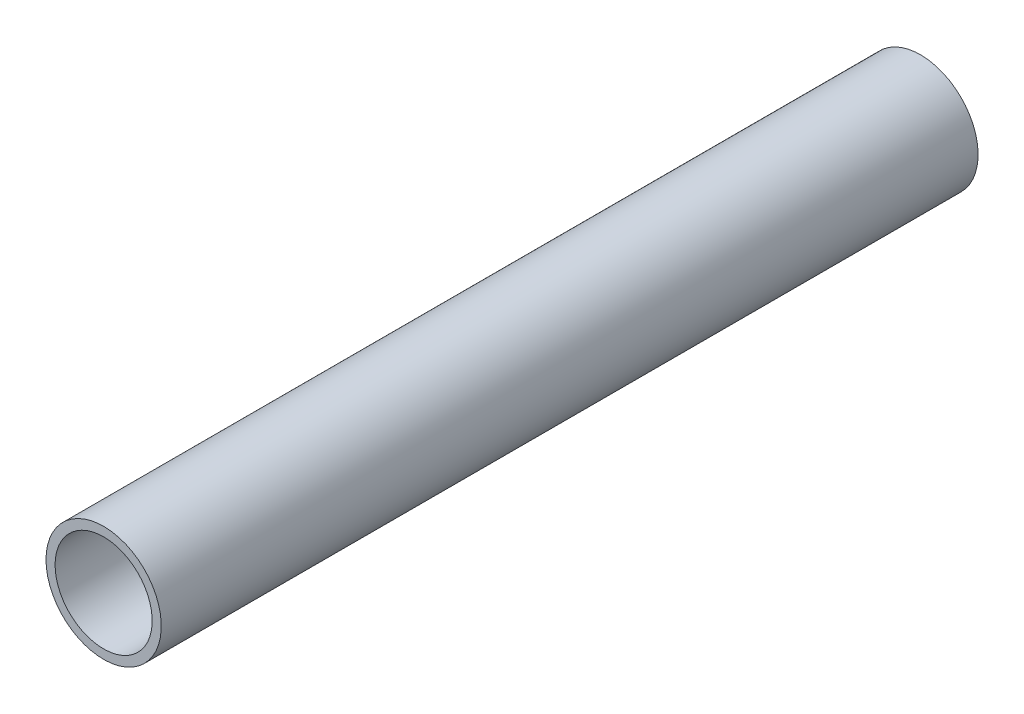
ISO-10303-21;
HEADER;
FILE_DESCRIPTION(('STEP AP214'),'2;1');
FILE_NAME('part.step','',(''),(''),'','','');
FILE_SCHEMA(('AUTOMOTIVE_DESIGN { 1 0 10303 214 1 1 1 1 }'));
ENDSEC;
DATA;
#1=APPLICATION_CONTEXT('core data for automotive mechanical design processes');
#2=APPLICATION_PROTOCOL_DEFINITION('international standard','automotive_design',2000,#1);
#3=PRODUCT_CONTEXT('',#1,'mechanical');
#4=PRODUCT('Part','Part','',(#3));
#5=PRODUCT_RELATED_PRODUCT_CATEGORY('part','',(#4));
#6=PRODUCT_DEFINITION_FORMATION('','',#4);
#7=PRODUCT_DEFINITION_CONTEXT('part definition',#1,'design');
#8=PRODUCT_DEFINITION('design','',#6,#7);
#9=PRODUCT_DEFINITION_SHAPE('','',#8);
#10=(LENGTH_UNIT() NAMED_UNIT(*) SI_UNIT(.MILLI.,.METRE.));
#11=(NAMED_UNIT(*) PLANE_ANGLE_UNIT() SI_UNIT($,.RADIAN.));
#12=(NAMED_UNIT(*) SI_UNIT($,.STERADIAN.) SOLID_ANGLE_UNIT());
#13=UNCERTAINTY_MEASURE_WITH_UNIT(LENGTH_MEASURE(1.E-05),#10,'distance_accuracy_value','');
#14=(GEOMETRIC_REPRESENTATION_CONTEXT(3) GLOBAL_UNCERTAINTY_ASSIGNED_CONTEXT((#13)) GLOBAL_UNIT_ASSIGNED_CONTEXT((#10,
#11,#12)) REPRESENTATION_CONTEXT('',''));
#15=CARTESIAN_POINT('',(0.,0.,0.));
#16=DIRECTION('',(0.,0.,1.));
#17=DIRECTION('',(1.,0.,0.));
#18=AXIS2_PLACEMENT_3D('',#15,#16,#17);
#19=CARTESIAN_POINT('',(0.,0.,-180.));
#20=DIRECTION('',(0.,0.,-1.));
#21=DIRECTION('',(1.,0.,0.));
#22=AXIS2_PLACEMENT_3D('',#19,#20,#21);
#23=PLANE('',#22);
#24=CARTESIAN_POINT('',(0.,0.,-180.));
#25=DIRECTION('',(0.,0.,1.));
#26=DIRECTION('',(1.,0.,0.));
#27=AXIS2_PLACEMENT_3D('',#24,#25,#26);
#28=CIRCLE('',#27,12.7);
#29=CARTESIAN_POINT('',(-12.7,0.,-180.));
#30=VERTEX_POINT('',#29);
#31=EDGE_CURVE('E10',#30,#30,#28,.T.);
#32=ORIENTED_EDGE('',*,*,#31,.F.);
#33=EDGE_LOOP('',(#32));
#34=FACE_BOUND('',#33,.T.);
#35=CARTESIAN_POINT('',(0.,0.,-180.));
#36=DIRECTION('',(0.,0.,1.));
#37=DIRECTION('',(1.,0.,0.));
#38=AXIS2_PLACEMENT_3D('',#35,#36,#37);
#39=CIRCLE('',#38,10.7);
#40=CARTESIAN_POINT('',(-10.7,0.,-180.));
#41=VERTEX_POINT('',#40);
#42=EDGE_CURVE('E44',#41,#41,#39,.T.);
#43=ORIENTED_EDGE('',*,*,#42,.T.);
#44=EDGE_LOOP('',(#43));
#45=FACE_BOUND('',#44,.T.);
#46=ADVANCED_FACE('F33',(#34,#45),#23,.T.);
#47=CARTESIAN_POINT('',(0.,0.,0.));
#48=DIRECTION('',(0.,0.,-1.));
#49=DIRECTION('',(1.,0.,0.));
#50=AXIS2_PLACEMENT_3D('',#47,#48,#49);
#51=PLANE('',#50);
#52=CARTESIAN_POINT('',(0.,0.,0.));
#53=DIRECTION('',(0.,0.,1.));
#54=DIRECTION('',(1.,0.,0.));
#55=AXIS2_PLACEMENT_3D('',#52,#53,#54);
#56=CIRCLE('',#55,12.7);
#57=CARTESIAN_POINT('',(-12.7,0.,0.));
#58=VERTEX_POINT('',#57);
#59=EDGE_CURVE('E37',#58,#58,#56,.T.);
#60=ORIENTED_EDGE('',*,*,#59,.T.);
#61=EDGE_LOOP('',(#60));
#62=FACE_BOUND('',#61,.T.);
#63=CARTESIAN_POINT('',(0.,0.,0.));
#64=DIRECTION('',(0.,0.,1.));
#65=DIRECTION('',(1.,0.,0.));
#66=AXIS2_PLACEMENT_3D('',#63,#64,#65);
#67=CIRCLE('',#66,10.7);
#68=CARTESIAN_POINT('',(-10.7,0.,0.));
#69=VERTEX_POINT('',#68);
#70=EDGE_CURVE('E46',#69,#69,#67,.T.);
#71=ORIENTED_EDGE('',*,*,#70,.F.);
#72=EDGE_LOOP('',(#71));
#73=FACE_BOUND('',#72,.T.);
#74=ADVANCED_FACE('F59',(#62,#73),#51,.F.);
#75=CARTESIAN_POINT('',(0.,0.,-180.));
#76=DIRECTION('',(0.,0.,1.));
#77=DIRECTION('',(-1.,0.,0.));
#78=AXIS2_PLACEMENT_3D('',#75,#76,#77);
#79=CYLINDRICAL_SURFACE('',#78,12.7);
#80=CARTESIAN_POINT('',(-12.7,0.,-180.));
#81=CARTESIAN_POINT('',(-12.7,0.,-178.125));
#82=CARTESIAN_POINT('',(-12.7,0.,-176.25));
#83=CARTESIAN_POINT('',(-12.7,0.,-172.5));
#84=CARTESIAN_POINT('',(-12.7,0.,-170.625));
#85=CARTESIAN_POINT('',(-12.7,0.,-166.875));
#86=CARTESIAN_POINT('',(-12.7,0.,-165.));
#87=CARTESIAN_POINT('',(-12.7,0.,-161.25));
#88=CARTESIAN_POINT('',(-12.7,0.,-159.375));
#89=CARTESIAN_POINT('',(-12.7,0.,-155.625));
#90=CARTESIAN_POINT('',(-12.7,0.,-153.75));
#91=CARTESIAN_POINT('',(-12.7,0.,-150.));
#92=CARTESIAN_POINT('',(-12.7,0.,-148.125));
#93=CARTESIAN_POINT('',(-12.7,0.,-144.375));
#94=CARTESIAN_POINT('',(-12.7,0.,-142.5));
#95=CARTESIAN_POINT('',(-12.7,0.,-138.75));
#96=CARTESIAN_POINT('',(-12.7,0.,-136.875));
#97=CARTESIAN_POINT('',(-12.7,0.,-133.125));
#98=CARTESIAN_POINT('',(-12.7,0.,-131.25));
#99=CARTESIAN_POINT('',(-12.7,0.,-127.5));
#100=CARTESIAN_POINT('',(-12.7,0.,-125.625));
#101=CARTESIAN_POINT('',(-12.7,0.,-121.875));
#102=CARTESIAN_POINT('',(-12.7,0.,-120.));
#103=CARTESIAN_POINT('',(-12.7,0.,-116.25));
#104=CARTESIAN_POINT('',(-12.7,0.,-114.375));
#105=CARTESIAN_POINT('',(-12.7,0.,-110.625));
#106=CARTESIAN_POINT('',(-12.7,0.,-108.75));
#107=CARTESIAN_POINT('',(-12.7,0.,-105.));
#108=CARTESIAN_POINT('',(-12.7,0.,-103.125));
#109=CARTESIAN_POINT('',(-12.7,0.,-99.375));
#110=CARTESIAN_POINT('',(-12.7,0.,-97.5));
#111=CARTESIAN_POINT('',(-12.7,0.,-93.75));
#112=CARTESIAN_POINT('',(-12.7,0.,-91.875));
#113=CARTESIAN_POINT('',(-12.7,0.,-88.125));
#114=CARTESIAN_POINT('',(-12.7,0.,-86.25));
#115=CARTESIAN_POINT('',(-12.7,0.,-82.5));
#116=CARTESIAN_POINT('',(-12.7,0.,-80.625));
#117=CARTESIAN_POINT('',(-12.7,0.,-76.875));
#118=CARTESIAN_POINT('',(-12.7,0.,-75.));
#119=CARTESIAN_POINT('',(-12.7,0.,-71.25));
#120=CARTESIAN_POINT('',(-12.7,0.,-69.375));
#121=CARTESIAN_POINT('',(-12.7,0.,-65.625));
#122=CARTESIAN_POINT('',(-12.7,0.,-63.75));
#123=CARTESIAN_POINT('',(-12.7,0.,-60.));
#124=CARTESIAN_POINT('',(-12.7,0.,-58.125));
#125=CARTESIAN_POINT('',(-12.7,0.,-54.375));
#126=CARTESIAN_POINT('',(-12.7,0.,-52.5));
#127=CARTESIAN_POINT('',(-12.7,0.,-48.75));
#128=CARTESIAN_POINT('',(-12.7,0.,-46.875));
#129=CARTESIAN_POINT('',(-12.7,0.,-43.125));
#130=CARTESIAN_POINT('',(-12.7,0.,-41.25));
#131=CARTESIAN_POINT('',(-12.7,0.,-37.5));
#132=CARTESIAN_POINT('',(-12.7,0.,-35.625));
#133=CARTESIAN_POINT('',(-12.7,0.,-31.875));
#134=CARTESIAN_POINT('',(-12.7,0.,-30.));
#135=CARTESIAN_POINT('',(-12.7,0.,-26.25));
#136=CARTESIAN_POINT('',(-12.7,0.,-24.375));
#137=CARTESIAN_POINT('',(-12.7,0.,-20.625));
#138=CARTESIAN_POINT('',(-12.7,0.,-18.75));
#139=CARTESIAN_POINT('',(-12.7,0.,-15.));
#140=CARTESIAN_POINT('',(-12.7,0.,-13.125));
#141=CARTESIAN_POINT('',(-12.7,0.,-9.37500000000003));
#142=CARTESIAN_POINT('',(-12.7,0.,-7.50000000000002));
#143=CARTESIAN_POINT('',(-12.7,0.,-3.75000000000002));
#144=CARTESIAN_POINT('',(-12.7,0.,-1.87500000000003));
#145=CARTESIAN_POINT('',(-12.7,0.,0.));
#146=B_SPLINE_CURVE_WITH_KNOTS('',3,(#80,#81,#82,#83,#84,#85,#86,#87,#88,#89,#90,#91,#92,#93,
#94,#95,#96,#97,#98,#99,#100,#101,#102,#103,#104,#105,#106,#107,#108,#109,#110,#111,#112,#113,
#114,#115,#116,#117,#118,#119,#120,#121,#122,#123,#124,#125,#126,#127,#128,#129,#130,#131,#132,
#133,#134,#135,#136,#137,#138,#139,#140,#141,#142,#143,#144,#145),.UNSPECIFIED.,.F.,.F.,(4,2,2,
2,2,2,2,2,2,2,2,2,2,2,2,2,2,2,2,2,2,2,2,2,2,2,2,2,2,2,2,2,4),(0.,5.62500000000002,11.25,16.875,
22.5,28.125,33.75,39.375,45.,50.625,56.25,61.875,67.5,73.125,78.75,84.375,90.,95.625,101.25,
106.875,112.5,118.125,123.75,129.375,135.,140.625,146.25,151.875,157.5,163.125,168.75,174.375,
180.),.UNSPECIFIED.);
#147=EDGE_CURVE('BSEAM35',#30,#58,#146,.T.);
#148=ORIENTED_EDGE('',*,*,#31,.T.);
#149=ORIENTED_EDGE('',*,*,#59,.F.);
#150=ORIENTED_EDGE('',*,*,#147,.T.);
#151=ORIENTED_EDGE('',*,*,#147,.F.);
#152=EDGE_LOOP('',(#148,#150,#149,#151));
#153=FACE_BOUND('',#152,.T.);
#154=ADVANCED_FACE('F35',(#153),#79,.T.);
#155=CARTESIAN_POINT('',(0.,0.,-180.));
#156=DIRECTION('',(0.,0.,1.));
#157=DIRECTION('',(-1.,0.,0.));
#158=AXIS2_PLACEMENT_3D('',#155,#156,#157);
#159=CYLINDRICAL_SURFACE('',#158,10.7);
#160=CARTESIAN_POINT('',(-10.7,0.,-180.));
#161=CARTESIAN_POINT('',(-10.7,0.,-178.125));
#162=CARTESIAN_POINT('',(-10.7,0.,-176.25));
#163=CARTESIAN_POINT('',(-10.7,0.,-172.5));
#164=CARTESIAN_POINT('',(-10.7,0.,-170.625));
#165=CARTESIAN_POINT('',(-10.7,0.,-166.875));
#166=CARTESIAN_POINT('',(-10.7,0.,-165.));
#167=CARTESIAN_POINT('',(-10.7,0.,-161.25));
#168=CARTESIAN_POINT('',(-10.7,0.,-159.375));
#169=CARTESIAN_POINT('',(-10.7,0.,-155.625));
#170=CARTESIAN_POINT('',(-10.7,0.,-153.75));
#171=CARTESIAN_POINT('',(-10.7,0.,-150.));
#172=CARTESIAN_POINT('',(-10.7,0.,-148.125));
#173=CARTESIAN_POINT('',(-10.7,0.,-144.375));
#174=CARTESIAN_POINT('',(-10.7,0.,-142.5));
#175=CARTESIAN_POINT('',(-10.7,0.,-138.75));
#176=CARTESIAN_POINT('',(-10.7,0.,-136.875));
#177=CARTESIAN_POINT('',(-10.7,0.,-133.125));
#178=CARTESIAN_POINT('',(-10.7,0.,-131.25));
#179=CARTESIAN_POINT('',(-10.7,0.,-127.5));
#180=CARTESIAN_POINT('',(-10.7,0.,-125.625));
#181=CARTESIAN_POINT('',(-10.7,0.,-121.875));
#182=CARTESIAN_POINT('',(-10.7,0.,-120.));
#183=CARTESIAN_POINT('',(-10.7,0.,-116.25));
#184=CARTESIAN_POINT('',(-10.7,0.,-114.375));
#185=CARTESIAN_POINT('',(-10.7,0.,-110.625));
#186=CARTESIAN_POINT('',(-10.7,0.,-108.75));
#187=CARTESIAN_POINT('',(-10.7,0.,-105.));
#188=CARTESIAN_POINT('',(-10.7,0.,-103.125));
#189=CARTESIAN_POINT('',(-10.7,0.,-99.375));
#190=CARTESIAN_POINT('',(-10.7,0.,-97.5));
#191=CARTESIAN_POINT('',(-10.7,0.,-93.75));
#192=CARTESIAN_POINT('',(-10.7,0.,-91.875));
#193=CARTESIAN_POINT('',(-10.7,0.,-88.125));
#194=CARTESIAN_POINT('',(-10.7,0.,-86.25));
#195=CARTESIAN_POINT('',(-10.7,0.,-82.5));
#196=CARTESIAN_POINT('',(-10.7,0.,-80.625));
#197=CARTESIAN_POINT('',(-10.7,0.,-76.875));
#198=CARTESIAN_POINT('',(-10.7,0.,-75.));
#199=CARTESIAN_POINT('',(-10.7,0.,-71.25));
#200=CARTESIAN_POINT('',(-10.7,0.,-69.375));
#201=CARTESIAN_POINT('',(-10.7,0.,-65.625));
#202=CARTESIAN_POINT('',(-10.7,0.,-63.75));
#203=CARTESIAN_POINT('',(-10.7,0.,-60.));
#204=CARTESIAN_POINT('',(-10.7,0.,-58.125));
#205=CARTESIAN_POINT('',(-10.7,0.,-54.375));
#206=CARTESIAN_POINT('',(-10.7,0.,-52.5));
#207=CARTESIAN_POINT('',(-10.7,0.,-48.75));
#208=CARTESIAN_POINT('',(-10.7,0.,-46.875));
#209=CARTESIAN_POINT('',(-10.7,0.,-43.125));
#210=CARTESIAN_POINT('',(-10.7,0.,-41.25));
#211=CARTESIAN_POINT('',(-10.7,0.,-37.5));
#212=CARTESIAN_POINT('',(-10.7,0.,-35.625));
#213=CARTESIAN_POINT('',(-10.7,0.,-31.875));
#214=CARTESIAN_POINT('',(-10.7,0.,-30.));
#215=CARTESIAN_POINT('',(-10.7,0.,-26.25));
#216=CARTESIAN_POINT('',(-10.7,0.,-24.375));
#217=CARTESIAN_POINT('',(-10.7,0.,-20.625));
#218=CARTESIAN_POINT('',(-10.7,0.,-18.75));
#219=CARTESIAN_POINT('',(-10.7,0.,-15.));
#220=CARTESIAN_POINT('',(-10.7,0.,-13.125));
#221=CARTESIAN_POINT('',(-10.7,0.,-9.37500000000003));
#222=CARTESIAN_POINT('',(-10.7,0.,-7.50000000000002));
#223=CARTESIAN_POINT('',(-10.7,0.,-3.75000000000002));
#224=CARTESIAN_POINT('',(-10.7,0.,-1.87500000000003));
#225=CARTESIAN_POINT('',(-10.7,0.,0.));
#226=B_SPLINE_CURVE_WITH_KNOTS('',3,(#160,#161,#162,#163,#164,#165,#166,#167,#168,#169,#170,
#171,#172,#173,#174,#175,#176,#177,#178,#179,#180,#181,#182,#183,#184,#185,#186,#187,#188,#189,
#190,#191,#192,#193,#194,#195,#196,#197,#198,#199,#200,#201,#202,#203,#204,#205,#206,#207,#208,
#209,#210,#211,#212,#213,#214,#215,#216,#217,#218,#219,#220,#221,#222,#223,#224,#225),
.UNSPECIFIED.,.F.,.F.,(4,2,2,2,2,2,2,2,2,2,2,2,2,2,2,2,2,2,2,2,2,2,2,2,2,2,2,2,2,2,2,2,4),(0.,
5.62499999999999,11.25,16.875,22.5,28.125,33.75,39.375,45.,50.625,56.25,61.875,67.5,73.125,
78.75,84.375,90.,95.625,101.25,106.875,112.5,118.125,123.75,129.375,135.,140.625,146.25,151.875,
157.5,163.125,168.75,174.375,180.),.UNSPECIFIED.);
#227=EDGE_CURVE('BSEAM53',#41,#69,#226,.T.);
#228=ORIENTED_EDGE('',*,*,#42,.F.);
#229=ORIENTED_EDGE('',*,*,#70,.T.);
#230=ORIENTED_EDGE('',*,*,#227,.T.);
#231=ORIENTED_EDGE('',*,*,#227,.F.);
#232=EDGE_LOOP('',(#228,#230,#229,#231));
#233=FACE_BOUND('',#232,.T.);
#234=ADVANCED_FACE('F53',(#233),#159,.F.);
#235=CLOSED_SHELL('',(#46,#74,#154,#234));
#236=MANIFOLD_SOLID_BREP('B2',#235);
#237=ADVANCED_BREP_SHAPE_REPRESENTATION('',(#18,#236),#14);
#238=SHAPE_DEFINITION_REPRESENTATION(#9,#237);
ENDSEC;
END-ISO-10303-21;
